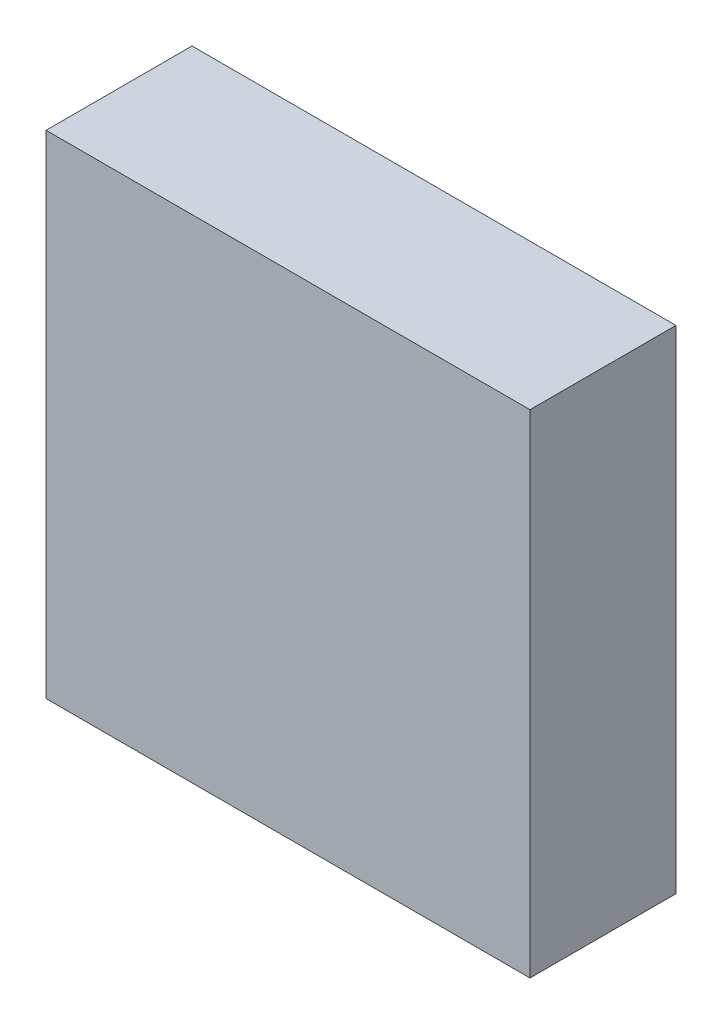
ISO-10303-21;
HEADER;
FILE_DESCRIPTION(('STEP AP214'),'2;1');
FILE_NAME('part.step','',(''),(''),'','','');
FILE_SCHEMA(('AUTOMOTIVE_DESIGN { 1 0 10303 214 1 1 1 1 }'));
ENDSEC;
DATA;
#1=APPLICATION_CONTEXT('core data for automotive mechanical design processes');
#2=APPLICATION_PROTOCOL_DEFINITION('international standard','automotive_design',2000,#1);
#3=PRODUCT_CONTEXT('',#1,'mechanical');
#4=PRODUCT('Part','Part','',(#3));
#5=PRODUCT_RELATED_PRODUCT_CATEGORY('part','',(#4));
#6=PRODUCT_DEFINITION_FORMATION('','',#4);
#7=PRODUCT_DEFINITION_CONTEXT('part definition',#1,'design');
#8=PRODUCT_DEFINITION('design','',#6,#7);
#9=PRODUCT_DEFINITION_SHAPE('','',#8);
#10=(LENGTH_UNIT() NAMED_UNIT(*) SI_UNIT(.MILLI.,.METRE.));
#11=(NAMED_UNIT(*) PLANE_ANGLE_UNIT() SI_UNIT($,.RADIAN.));
#12=(NAMED_UNIT(*) SI_UNIT($,.STERADIAN.) SOLID_ANGLE_UNIT());
#13=UNCERTAINTY_MEASURE_WITH_UNIT(LENGTH_MEASURE(1.E-05),#10,'distance_accuracy_value','');
#14=(GEOMETRIC_REPRESENTATION_CONTEXT(3) GLOBAL_UNCERTAINTY_ASSIGNED_CONTEXT((#13)) GLOBAL_UNIT_ASSIGNED_CONTEXT((#10,
#11,#12)) REPRESENTATION_CONTEXT('',''));
#15=CARTESIAN_POINT('',(0.,0.,0.));
#16=DIRECTION('',(0.,0.,1.));
#17=DIRECTION('',(1.,0.,0.));
#18=AXIS2_PLACEMENT_3D('',#15,#16,#17);
#19=CARTESIAN_POINT('',(-7.493,-7.62,4.52000112));
#20=DIRECTION('',(0.,0.,-1.));
#21=DIRECTION('',(-1.,0.,0.));
#22=AXIS2_PLACEMENT_3D('',#19,#20,#21);
#23=PLANE('',#22);
#24=DIRECTION('',(0.,1.,0.));
#25=VECTOR('',#24,1.);
#26=CARTESIAN_POINT('',(7.493,-7.62,4.52000112));
#27=LINE('',#26,#25);
#28=CARTESIAN_POINT('',(7.493,-7.62,4.52000112));
#29=VERTEX_POINT('',#28);
#30=CARTESIAN_POINT('',(7.493,7.62,4.52000112));
#31=VERTEX_POINT('',#30);
#32=EDGE_CURVE('E55',#29,#31,#27,.T.);
#33=ORIENTED_EDGE('',*,*,#32,.T.);
#34=DIRECTION('',(1.,0.,0.));
#35=VECTOR('',#34,1.);
#36=CARTESIAN_POINT('',(7.493,7.62,4.52000112));
#37=LINE('',#36,#35);
#38=CARTESIAN_POINT('',(-7.493,7.62,4.52000112));
#39=VERTEX_POINT('',#38);
#40=EDGE_CURVE('E57',#31,#39,#37,.F.);
#41=ORIENTED_EDGE('',*,*,#40,.T.);
#42=DIRECTION('',(0.,1.,0.));
#43=VECTOR('',#42,1.);
#44=CARTESIAN_POINT('',(-7.493,7.62,4.52000112));
#45=LINE('',#44,#43);
#46=CARTESIAN_POINT('',(-7.493,-7.62,4.52000112));
#47=VERTEX_POINT('',#46);
#48=EDGE_CURVE('E20',#39,#47,#45,.F.);
#49=ORIENTED_EDGE('',*,*,#48,.T.);
#50=DIRECTION('',(1.,0.,0.));
#51=VECTOR('',#50,1.);
#52=CARTESIAN_POINT('',(-7.493,-7.62,4.52000112));
#53=LINE('',#52,#51);
#54=EDGE_CURVE('E80',#47,#29,#53,.T.);
#55=ORIENTED_EDGE('',*,*,#54,.T.);
#56=EDGE_LOOP('',(#33,#41,#49,#55));
#57=FACE_BOUND('',#56,.T.);
#58=ADVANCED_FACE('F17',(#57),#23,.F.);
#59=CARTESIAN_POINT('',(-7.493,7.62,0.));
#60=DIRECTION('',(1.,0.,0.));
#61=DIRECTION('',(0.,0.,-1.));
#62=AXIS2_PLACEMENT_3D('',#59,#60,#61);
#63=PLANE('',#62);
#64=DIRECTION('',(0.,0.,1.));
#65=VECTOR('',#64,1.);
#66=CARTESIAN_POINT('',(-7.493,-7.62,0.));
#67=LINE('',#66,#65);
#68=CARTESIAN_POINT('',(-7.493,-7.62,0.));
#69=VERTEX_POINT('',#68);
#70=EDGE_CURVE('E68',#69,#47,#67,.T.);
#71=ORIENTED_EDGE('',*,*,#70,.T.);
#72=ORIENTED_EDGE('',*,*,#48,.F.);
#73=DIRECTION('',(0.,0.,-1.));
#74=VECTOR('',#73,1.);
#75=CARTESIAN_POINT('',(-7.493,7.62,0.));
#76=LINE('',#75,#74);
#77=CARTESIAN_POINT('',(-7.493,7.62,0.));
#78=VERTEX_POINT('',#77);
#79=EDGE_CURVE('E63',#39,#78,#76,.T.);
#80=ORIENTED_EDGE('',*,*,#79,.T.);
#81=DIRECTION('',(0.,1.,0.));
#82=VECTOR('',#81,1.);
#83=CARTESIAN_POINT('',(-7.493,-7.62,0.));
#84=LINE('',#83,#82);
#85=EDGE_CURVE('E83',#69,#78,#84,.T.);
#86=ORIENTED_EDGE('',*,*,#85,.F.);
#87=EDGE_LOOP('',(#71,#72,#80,#86));
#88=FACE_BOUND('',#87,.T.);
#89=ADVANCED_FACE('F65',(#88),#63,.F.);
#90=CARTESIAN_POINT('',(7.493,7.62,0.));
#91=DIRECTION('',(0.,-1.,0.));
#92=DIRECTION('',(0.,0.,-1.));
#93=AXIS2_PLACEMENT_3D('',#90,#91,#92);
#94=PLANE('',#93);
#95=ORIENTED_EDGE('',*,*,#79,.F.);
#96=ORIENTED_EDGE('',*,*,#40,.F.);
#97=DIRECTION('',(0.,0.,1.));
#98=VECTOR('',#97,1.);
#99=CARTESIAN_POINT('',(7.493,7.62,0.));
#100=LINE('',#99,#98);
#101=CARTESIAN_POINT('',(7.493,7.62,0.));
#102=VERTEX_POINT('',#101);
#103=EDGE_CURVE('E75',#31,#102,#100,.F.);
#104=ORIENTED_EDGE('',*,*,#103,.T.);
#105=DIRECTION('',(-1.,0.,0.));
#106=VECTOR('',#105,1.);
#107=CARTESIAN_POINT('',(-7.493,7.62,0.));
#108=LINE('',#107,#106);
#109=EDGE_CURVE('E72',#78,#102,#108,.F.);
#110=ORIENTED_EDGE('',*,*,#109,.F.);
#111=EDGE_LOOP('',(#95,#96,#104,#110));
#112=FACE_BOUND('',#111,.T.);
#113=ADVANCED_FACE('F70',(#112),#94,.F.);
#114=CARTESIAN_POINT('',(7.493,-7.62,0.));
#115=DIRECTION('',(-1.,0.,0.));
#116=DIRECTION('',(0.,0.,1.));
#117=AXIS2_PLACEMENT_3D('',#114,#115,#116);
#118=PLANE('',#117);
#119=ORIENTED_EDGE('',*,*,#103,.F.);
#120=ORIENTED_EDGE('',*,*,#32,.F.);
#121=DIRECTION('',(0.,0.,1.));
#122=VECTOR('',#121,1.);
#123=CARTESIAN_POINT('',(7.493,-7.62,0.));
#124=LINE('',#123,#122);
#125=CARTESIAN_POINT('',(7.493,-7.62,0.));
#126=VERTEX_POINT('',#125);
#127=EDGE_CURVE('E35',#29,#126,#124,.F.);
#128=ORIENTED_EDGE('',*,*,#127,.T.);
#129=DIRECTION('',(0.,1.,0.));
#130=VECTOR('',#129,1.);
#131=CARTESIAN_POINT('',(7.493,-7.62,0.));
#132=LINE('',#131,#130);
#133=EDGE_CURVE('E26',#102,#126,#132,.F.);
#134=ORIENTED_EDGE('',*,*,#133,.F.);
#135=EDGE_LOOP('',(#119,#120,#128,#134));
#136=FACE_BOUND('',#135,.T.);
#137=ADVANCED_FACE('F89',(#136),#118,.F.);
#138=CARTESIAN_POINT('',(-7.493,-7.62,0.));
#139=DIRECTION('',(0.,1.,0.));
#140=DIRECTION('',(0.,0.,1.));
#141=AXIS2_PLACEMENT_3D('',#138,#139,#140);
#142=PLANE('',#141);
#143=ORIENTED_EDGE('',*,*,#127,.F.);
#144=ORIENTED_EDGE('',*,*,#54,.F.);
#145=ORIENTED_EDGE('',*,*,#70,.F.);
#146=DIRECTION('',(-1.,0.,0.));
#147=VECTOR('',#146,1.);
#148=CARTESIAN_POINT('',(-7.493,-7.62,0.));
#149=LINE('',#148,#147);
#150=EDGE_CURVE('E11',#126,#69,#149,.T.);
#151=ORIENTED_EDGE('',*,*,#150,.F.);
#152=EDGE_LOOP('',(#143,#144,#145,#151));
#153=FACE_BOUND('',#152,.T.);
#154=ADVANCED_FACE('F91',(#153),#142,.F.);
#155=CARTESIAN_POINT('',(-7.493,-7.62,0.));
#156=DIRECTION('',(0.,0.,-1.));
#157=DIRECTION('',(-1.,0.,0.));
#158=AXIS2_PLACEMENT_3D('',#155,#156,#157);
#159=PLANE('',#158);
#160=ORIENTED_EDGE('',*,*,#133,.T.);
#161=ORIENTED_EDGE('',*,*,#150,.T.);
#162=ORIENTED_EDGE('',*,*,#85,.T.);
#163=ORIENTED_EDGE('',*,*,#109,.T.);
#164=EDGE_LOOP('',(#160,#161,#162,#163));
#165=FACE_BOUND('',#164,.T.);
#166=ADVANCED_FACE('F88',(#165),#159,.T.);
#167=CLOSED_SHELL('',(#58,#89,#113,#137,#154,#166));
#168=MANIFOLD_SOLID_BREP('B1',#167);
#169=ADVANCED_BREP_SHAPE_REPRESENTATION('',(#18,#168),#14);
#170=SHAPE_DEFINITION_REPRESENTATION(#9,#169);
ENDSEC;
END-ISO-10303-21;
